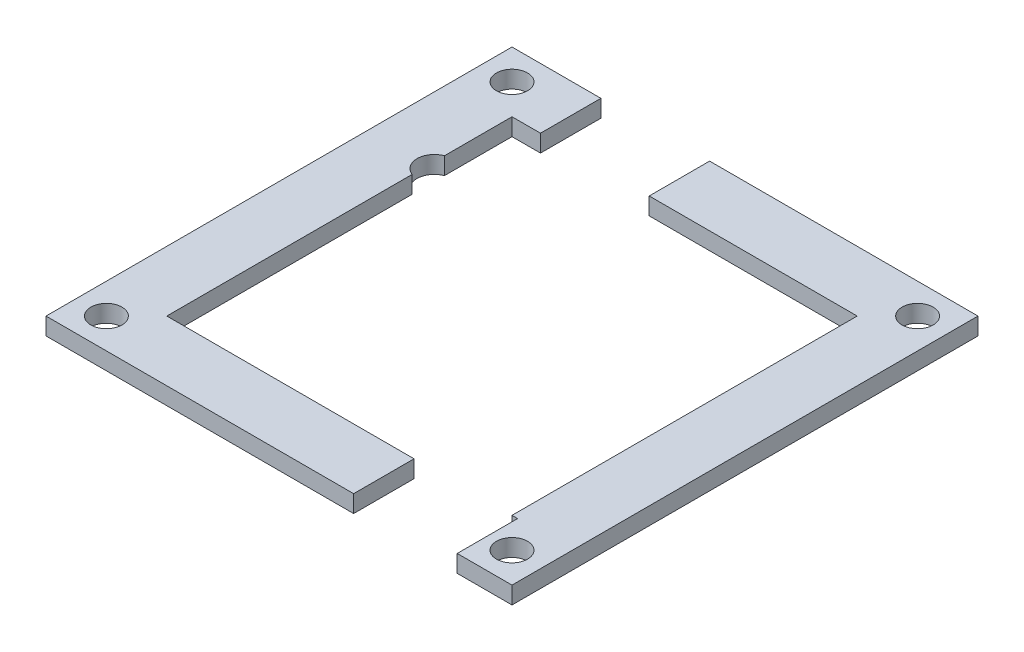
ISO-10303-21;
HEADER;
FILE_DESCRIPTION(('STEP AP214'),'2;1');
FILE_NAME('part.step','',(''),(''),'','','');
FILE_SCHEMA(('AUTOMOTIVE_DESIGN { 1 0 10303 214 1 1 1 1 }'));
ENDSEC;
DATA;
#1=APPLICATION_CONTEXT('core data for automotive mechanical design processes');
#2=APPLICATION_PROTOCOL_DEFINITION('international standard','automotive_design',2000,#1);
#3=PRODUCT_CONTEXT('',#1,'mechanical');
#4=PRODUCT('Part','Part','',(#3));
#5=PRODUCT_RELATED_PRODUCT_CATEGORY('part','',(#4));
#6=PRODUCT_DEFINITION_FORMATION('','',#4);
#7=PRODUCT_DEFINITION_CONTEXT('part definition',#1,'design');
#8=PRODUCT_DEFINITION('design','',#6,#7);
#9=PRODUCT_DEFINITION_SHAPE('','',#8);
#10=(LENGTH_UNIT() NAMED_UNIT(*) SI_UNIT(.MILLI.,.METRE.));
#11=(NAMED_UNIT(*) PLANE_ANGLE_UNIT() SI_UNIT($,.RADIAN.));
#12=(NAMED_UNIT(*) SI_UNIT($,.STERADIAN.) SOLID_ANGLE_UNIT());
#13=UNCERTAINTY_MEASURE_WITH_UNIT(LENGTH_MEASURE(1.E-05),#10,'distance_accuracy_value','');
#14=(GEOMETRIC_REPRESENTATION_CONTEXT(3) GLOBAL_UNCERTAINTY_ASSIGNED_CONTEXT((#13)) GLOBAL_UNIT_ASSIGNED_CONTEXT((#10,
#11,#12)) REPRESENTATION_CONTEXT('',''));
#15=CARTESIAN_POINT('',(0.,0.,0.));
#16=DIRECTION('',(0.,0.,1.));
#17=DIRECTION('',(1.,0.,0.));
#18=AXIS2_PLACEMENT_3D('',#15,#16,#17);
#19=CARTESIAN_POINT('',(-4.1,2.,0.));
#20=DIRECTION('',(-1.,0.,0.));
#21=DIRECTION('',(0.,0.,1.));
#22=AXIS2_PLACEMENT_3D('',#19,#20,#21);
#23=PLANE('',#22);
#24=DIRECTION('',(0.,0.,-1.));
#25=VECTOR('',#24,1.);
#26=CARTESIAN_POINT('',(-4.1,0.,0.));
#27=LINE('',#26,#25);
#28=CARTESIAN_POINT('',(-4.1,0.,-20.));
#29=VERTEX_POINT('',#28);
#30=CARTESIAN_POINT('',(-4.1,0.,-27.));
#31=VERTEX_POINT('',#30);
#32=EDGE_CURVE('E215',#29,#31,#27,.T.);
#33=ORIENTED_EDGE('',*,*,#32,.F.);
#34=DIRECTION('',(0.,-1.,0.));
#35=VECTOR('',#34,1.);
#36=CARTESIAN_POINT('',(-4.1,2.,-20.));
#37=LINE('',#36,#35);
#38=CARTESIAN_POINT('',(-4.1,2.,-20.));
#39=VERTEX_POINT('',#38);
#40=EDGE_CURVE('E13',#39,#29,#37,.T.);
#41=ORIENTED_EDGE('',*,*,#40,.F.);
#42=DIRECTION('',(0.,0.,-1.));
#43=VECTOR('',#42,1.);
#44=CARTESIAN_POINT('',(-4.1,2.,0.));
#45=LINE('',#44,#43);
#46=CARTESIAN_POINT('',(-4.1,2.,-27.));
#47=VERTEX_POINT('',#46);
#48=EDGE_CURVE('E355',#39,#47,#45,.T.);
#49=ORIENTED_EDGE('',*,*,#48,.T.);
#50=DIRECTION('',(0.,-1.,0.));
#51=VECTOR('',#50,1.);
#52=CARTESIAN_POINT('',(-4.1,2.,-27.));
#53=LINE('',#52,#51);
#54=EDGE_CURVE('E150',#47,#31,#53,.T.);
#55=ORIENTED_EDGE('',*,*,#54,.T.);
#56=EDGE_LOOP('',(#33,#41,#49,#55));
#57=FACE_BOUND('',#56,.T.);
#58=ADVANCED_FACE('F99',(#57),#23,.T.);
#59=CARTESIAN_POINT('',(0.,2.,-20.));
#60=DIRECTION('',(0.,0.,-1.));
#61=DIRECTION('',(-1.,0.,0.));
#62=AXIS2_PLACEMENT_3D('',#59,#60,#61);
#63=PLANE('',#62);
#64=DIRECTION('',(1.,0.,0.));
#65=VECTOR('',#64,1.);
#66=CARTESIAN_POINT('',(0.,0.,-20.));
#67=LINE('',#66,#65);
#68=CARTESIAN_POINT('',(20.,0.,-20.));
#69=VERTEX_POINT('',#68);
#70=EDGE_CURVE('E213',#29,#69,#67,.T.);
#71=ORIENTED_EDGE('',*,*,#70,.T.);
#72=DIRECTION('',(0.,-1.,0.));
#73=VECTOR('',#72,1.);
#74=CARTESIAN_POINT('',(20.,2.,-20.));
#75=LINE('',#74,#73);
#76=CARTESIAN_POINT('',(20.,2.,-20.));
#77=VERTEX_POINT('',#76);
#78=EDGE_CURVE('E108',#77,#69,#75,.T.);
#79=ORIENTED_EDGE('',*,*,#78,.F.);
#80=DIRECTION('',(1.,0.,0.));
#81=VECTOR('',#80,1.);
#82=CARTESIAN_POINT('',(0.,2.,-20.));
#83=LINE('',#82,#81);
#84=EDGE_CURVE('E352',#39,#77,#83,.T.);
#85=ORIENTED_EDGE('',*,*,#84,.F.);
#86=ORIENTED_EDGE('',*,*,#40,.T.);
#87=EDGE_LOOP('',(#71,#79,#85,#86));
#88=FACE_BOUND('',#87,.T.);
#89=ADVANCED_FACE('F214',(#88),#63,.F.);
#90=CARTESIAN_POINT('',(20.,2.,0.));
#91=DIRECTION('',(-1.,0.,0.));
#92=DIRECTION('',(0.,0.,1.));
#93=AXIS2_PLACEMENT_3D('',#90,#91,#92);
#94=PLANE('',#93);
#95=DIRECTION('',(0.,0.,-1.));
#96=VECTOR('',#95,1.);
#97=CARTESIAN_POINT('',(20.,0.,0.));
#98=LINE('',#97,#96);
#99=CARTESIAN_POINT('',(20.,0.,20.));
#100=VERTEX_POINT('',#99);
#101=EDGE_CURVE('E207',#100,#69,#98,.T.);
#102=ORIENTED_EDGE('',*,*,#101,.F.);
#103=DIRECTION('',(0.,-1.,0.));
#104=VECTOR('',#103,1.);
#105=CARTESIAN_POINT('',(20.,2.,20.));
#106=LINE('',#105,#104);
#107=CARTESIAN_POINT('',(20.,2.,20.));
#108=VERTEX_POINT('',#107);
#109=EDGE_CURVE('E199',#108,#100,#106,.T.);
#110=ORIENTED_EDGE('',*,*,#109,.F.);
#111=DIRECTION('',(0.,0.,-1.));
#112=VECTOR('',#111,1.);
#113=CARTESIAN_POINT('',(20.,2.,0.));
#114=LINE('',#113,#112);
#115=EDGE_CURVE('E210',#108,#77,#114,.T.);
#116=ORIENTED_EDGE('',*,*,#115,.T.);
#117=ORIENTED_EDGE('',*,*,#78,.T.);
#118=EDGE_LOOP('',(#102,#110,#116,#117));
#119=FACE_BOUND('',#118,.T.);
#120=ADVANCED_FACE('F205',(#119),#94,.T.);
#121=CARTESIAN_POINT('',(2.13504427812533E-13,2.,20.0000000000002));
#122=DIRECTION('',(0.,0.,1.));
#123=DIRECTION('',(1.,0.,0.));
#124=AXIS2_PLACEMENT_3D('',#121,#122,#123);
#125=PLANE('',#124);
#126=DIRECTION('',(-1.,0.,0.));
#127=VECTOR('',#126,1.);
#128=CARTESIAN_POINT('',(2.13504427812533E-13,0.,20.0000000000002));
#129=LINE('',#128,#127);
#130=CARTESIAN_POINT('',(20.65,0.,20.));
#131=VERTEX_POINT('',#130);
#132=EDGE_CURVE('E220',#131,#100,#129,.T.);
#133=ORIENTED_EDGE('',*,*,#132,.F.);
#134=DIRECTION('',(0.,-1.,0.));
#135=VECTOR('',#134,1.);
#136=CARTESIAN_POINT('',(20.65,2.,20.));
#137=LINE('',#136,#135);
#138=CARTESIAN_POINT('',(20.65,2.,20.));
#139=VERTEX_POINT('',#138);
#140=EDGE_CURVE('E193',#139,#131,#137,.T.);
#141=ORIENTED_EDGE('',*,*,#140,.F.);
#142=DIRECTION('',(-1.,0.,0.));
#143=VECTOR('',#142,1.);
#144=CARTESIAN_POINT('',(2.13504427812533E-13,2.,20.0000000000002));
#145=LINE('',#144,#143);
#146=EDGE_CURVE('E351',#139,#108,#145,.T.);
#147=ORIENTED_EDGE('',*,*,#146,.T.);
#148=ORIENTED_EDGE('',*,*,#109,.T.);
#149=EDGE_LOOP('',(#133,#141,#147,#148));
#150=FACE_BOUND('',#149,.T.);
#151=ADVANCED_FACE('F279',(#150),#125,.T.);
#152=CARTESIAN_POINT('',(20.65,2.,0.));
#153=DIRECTION('',(1.,0.,0.));
#154=DIRECTION('',(0.,0.,-1.));
#155=AXIS2_PLACEMENT_3D('',#152,#153,#154);
#156=PLANE('',#155);
#157=DIRECTION('',(0.,0.,1.));
#158=VECTOR('',#157,1.);
#159=CARTESIAN_POINT('',(20.65,0.,0.));
#160=LINE('',#159,#158);
#161=CARTESIAN_POINT('',(20.65,0.,27.));
#162=VERTEX_POINT('',#161);
#163=EDGE_CURVE('E222',#131,#162,#160,.T.);
#164=ORIENTED_EDGE('',*,*,#163,.T.);
#165=DIRECTION('',(0.,-1.,0.));
#166=VECTOR('',#165,1.);
#167=CARTESIAN_POINT('',(20.65,2.,27.));
#168=LINE('',#167,#166);
#169=CARTESIAN_POINT('',(20.65,2.,27.));
#170=VERTEX_POINT('',#169);
#171=EDGE_CURVE('E191',#170,#162,#168,.T.);
#172=ORIENTED_EDGE('',*,*,#171,.F.);
#173=DIRECTION('',(0.,0.,1.));
#174=VECTOR('',#173,1.);
#175=CARTESIAN_POINT('',(20.65,2.,0.));
#176=LINE('',#175,#174);
#177=EDGE_CURVE('E184',#139,#170,#176,.T.);
#178=ORIENTED_EDGE('',*,*,#177,.F.);
#179=ORIENTED_EDGE('',*,*,#140,.T.);
#180=EDGE_LOOP('',(#164,#172,#178,#179));
#181=FACE_BOUND('',#180,.T.);
#182=ADVANCED_FACE('F276',(#181),#156,.F.);
#183=CARTESIAN_POINT('',(0.,2.,27.));
#184=DIRECTION('',(0.,0.,-1.));
#185=DIRECTION('',(-1.,0.,0.));
#186=AXIS2_PLACEMENT_3D('',#183,#184,#185);
#187=PLANE('',#186);
#188=DIRECTION('',(1.,0.,0.));
#189=VECTOR('',#188,1.);
#190=CARTESIAN_POINT('',(0.,0.,27.));
#191=LINE('',#190,#189);
#192=CARTESIAN_POINT('',(27.,0.,27.));
#193=VERTEX_POINT('',#192);
#194=EDGE_CURVE('E190',#162,#193,#191,.T.);
#195=ORIENTED_EDGE('',*,*,#194,.T.);
#196=DIRECTION('',(0.,-1.,0.));
#197=VECTOR('',#196,1.);
#198=CARTESIAN_POINT('',(27.,2.,27.));
#199=LINE('',#198,#197);
#200=CARTESIAN_POINT('',(27.,2.,27.));
#201=VERTEX_POINT('',#200);
#202=EDGE_CURVE('E175',#201,#193,#199,.T.);
#203=ORIENTED_EDGE('',*,*,#202,.F.);
#204=DIRECTION('',(1.,0.,0.));
#205=VECTOR('',#204,1.);
#206=CARTESIAN_POINT('',(0.,2.,27.));
#207=LINE('',#206,#205);
#208=EDGE_CURVE('E178',#170,#201,#207,.T.);
#209=ORIENTED_EDGE('',*,*,#208,.F.);
#210=ORIENTED_EDGE('',*,*,#171,.T.);
#211=EDGE_LOOP('',(#195,#203,#209,#210));
#212=FACE_BOUND('',#211,.T.);
#213=ADVANCED_FACE('F189',(#212),#187,.F.);
#214=CARTESIAN_POINT('',(27.,2.,0.));
#215=DIRECTION('',(-1.,0.,0.));
#216=DIRECTION('',(0.,0.,1.));
#217=AXIS2_PLACEMENT_3D('',#214,#215,#216);
#218=PLANE('',#217);
#219=DIRECTION('',(0.,0.,-1.));
#220=VECTOR('',#219,1.);
#221=CARTESIAN_POINT('',(27.,0.,0.));
#222=LINE('',#221,#220);
#223=CARTESIAN_POINT('',(27.,0.,-27.));
#224=VERTEX_POINT('',#223);
#225=EDGE_CURVE('E229',#193,#224,#222,.T.);
#226=ORIENTED_EDGE('',*,*,#225,.T.);
#227=DIRECTION('',(0.,-1.,0.));
#228=VECTOR('',#227,1.);
#229=CARTESIAN_POINT('',(27.,2.,-27.));
#230=LINE('',#229,#228);
#231=CARTESIAN_POINT('',(27.,2.,-27.));
#232=VERTEX_POINT('',#231);
#233=EDGE_CURVE('E177',#232,#224,#230,.T.);
#234=ORIENTED_EDGE('',*,*,#233,.F.);
#235=DIRECTION('',(0.,0.,-1.));
#236=VECTOR('',#235,1.);
#237=CARTESIAN_POINT('',(27.,2.,0.));
#238=LINE('',#237,#236);
#239=EDGE_CURVE('E170',#201,#232,#238,.T.);
#240=ORIENTED_EDGE('',*,*,#239,.F.);
#241=ORIENTED_EDGE('',*,*,#202,.T.);
#242=EDGE_LOOP('',(#226,#234,#240,#241));
#243=FACE_BOUND('',#242,.T.);
#244=ADVANCED_FACE('F173',(#243),#218,.F.);
#245=CARTESIAN_POINT('',(23.5,2.,23.5));
#246=DIRECTION('',(0.,-1.,0.));
#247=DIRECTION('',(0.,0.,-1.));
#248=AXIS2_PLACEMENT_3D('',#245,#246,#247);
#249=CYLINDRICAL_SURFACE('',#248,1.8);
#250=CARTESIAN_POINT('',(23.5,2.,23.5));
#251=DIRECTION('',(0.,1.,0.));
#252=DIRECTION('',(0.,0.,1.));
#253=AXIS2_PLACEMENT_3D('',#250,#251,#252);
#254=CIRCLE('',#253,1.8);
#255=CARTESIAN_POINT('',(23.5,2.,25.3));
#256=VERTEX_POINT('',#255);
#257=EDGE_CURVE('E259',#256,#256,#254,.T.);
#258=ORIENTED_EDGE('',*,*,#257,.T.);
#259=EDGE_LOOP('',(#258));
#260=FACE_BOUND('',#259,.T.);
#261=CARTESIAN_POINT('',(23.5,0.,23.5));
#262=DIRECTION('',(0.,1.,0.));
#263=DIRECTION('',(0.,0.,1.));
#264=AXIS2_PLACEMENT_3D('',#261,#262,#263);
#265=CIRCLE('',#264,1.8);
#266=CARTESIAN_POINT('',(23.5,0.,25.3));
#267=VERTEX_POINT('',#266);
#268=EDGE_CURVE('E237',#267,#267,#265,.T.);
#269=ORIENTED_EDGE('',*,*,#268,.F.);
#270=EDGE_LOOP('',(#269));
#271=FACE_BOUND('',#270,.T.);
#272=ADVANCED_FACE('F246',(#260,#271),#249,.F.);
#273=CARTESIAN_POINT('',(23.5,2.,-23.5));
#274=DIRECTION('',(0.,-1.,0.));
#275=DIRECTION('',(0.,0.,-1.));
#276=AXIS2_PLACEMENT_3D('',#273,#274,#275);
#277=CYLINDRICAL_SURFACE('',#276,1.8);
#278=CARTESIAN_POINT('',(23.5,2.,-23.5));
#279=DIRECTION('',(0.,1.,0.));
#280=DIRECTION('',(0.,0.,1.));
#281=AXIS2_PLACEMENT_3D('',#278,#279,#280);
#282=CIRCLE('',#281,1.8);
#283=CARTESIAN_POINT('',(23.5,2.,-21.7));
#284=VERTEX_POINT('',#283);
#285=EDGE_CURVE('E231',#284,#284,#282,.T.);
#286=ORIENTED_EDGE('',*,*,#285,.T.);
#287=EDGE_LOOP('',(#286));
#288=FACE_BOUND('',#287,.T.);
#289=CARTESIAN_POINT('',(23.5,0.,-23.5));
#290=DIRECTION('',(0.,1.,0.));
#291=DIRECTION('',(0.,0.,1.));
#292=AXIS2_PLACEMENT_3D('',#289,#290,#291);
#293=CIRCLE('',#292,1.8);
#294=CARTESIAN_POINT('',(23.5,0.,-21.7));
#295=VERTEX_POINT('',#294);
#296=EDGE_CURVE('E234',#295,#295,#293,.T.);
#297=ORIENTED_EDGE('',*,*,#296,.F.);
#298=EDGE_LOOP('',(#297));
#299=FACE_BOUND('',#298,.T.);
#300=ADVANCED_FACE('F101',(#288,#299),#277,.F.);
#301=CARTESIAN_POINT('',(0.,2.,-27.));
#302=DIRECTION('',(0.,0.,1.));
#303=DIRECTION('',(1.,0.,0.));
#304=AXIS2_PLACEMENT_3D('',#301,#302,#303);
#305=PLANE('',#304);
#306=DIRECTION('',(-1.,0.,0.));
#307=VECTOR('',#306,1.);
#308=CARTESIAN_POINT('',(0.,0.,-27.));
#309=LINE('',#308,#307);
#310=EDGE_CURVE('E143',#224,#31,#309,.T.);
#311=ORIENTED_EDGE('',*,*,#310,.T.);
#312=ORIENTED_EDGE('',*,*,#54,.F.);
#313=DIRECTION('',(-1.,0.,0.));
#314=VECTOR('',#313,1.);
#315=CARTESIAN_POINT('',(0.,2.,-27.));
#316=LINE('',#315,#314);
#317=EDGE_CURVE('E116',#232,#47,#316,.T.);
#318=ORIENTED_EDGE('',*,*,#317,.F.);
#319=ORIENTED_EDGE('',*,*,#233,.T.);
#320=EDGE_LOOP('',(#311,#312,#318,#319));
#321=FACE_BOUND('',#320,.T.);
#322=ADVANCED_FACE('F253',(#321),#305,.F.);
#323=CARTESIAN_POINT('',(0.,2.,0.));
#324=DIRECTION('',(0.,1.,0.));
#325=DIRECTION('',(0.,0.,1.));
#326=AXIS2_PLACEMENT_3D('',#323,#324,#325);
#327=PLANE('',#326);
#328=ORIENTED_EDGE('',*,*,#285,.F.);
#329=EDGE_LOOP('',(#328));
#330=FACE_BOUND('',#329,.T.);
#331=ORIENTED_EDGE('',*,*,#257,.F.);
#332=EDGE_LOOP('',(#331));
#333=FACE_BOUND('',#332,.T.);
#334=ORIENTED_EDGE('',*,*,#48,.F.);
#335=ORIENTED_EDGE('',*,*,#84,.T.);
#336=ORIENTED_EDGE('',*,*,#115,.F.);
#337=ORIENTED_EDGE('',*,*,#146,.F.);
#338=ORIENTED_EDGE('',*,*,#177,.T.);
#339=ORIENTED_EDGE('',*,*,#208,.T.);
#340=ORIENTED_EDGE('',*,*,#239,.T.);
#341=ORIENTED_EDGE('',*,*,#317,.T.);
#342=EDGE_LOOP('',(#334,#335,#336,#337,#338,#339,#340,#341));
#343=FACE_BOUND('',#342,.T.);
#344=ADVANCED_FACE('F181',(#330,#333,#343),#327,.T.);
#345=CARTESIAN_POINT('',(0.,0.,0.));
#346=DIRECTION('',(0.,1.,0.));
#347=DIRECTION('',(0.,0.,1.));
#348=AXIS2_PLACEMENT_3D('',#345,#346,#347);
#349=PLANE('',#348);
#350=ORIENTED_EDGE('',*,*,#296,.T.);
#351=EDGE_LOOP('',(#350));
#352=FACE_BOUND('',#351,.T.);
#353=ORIENTED_EDGE('',*,*,#268,.T.);
#354=EDGE_LOOP('',(#353));
#355=FACE_BOUND('',#354,.T.);
#356=ORIENTED_EDGE('',*,*,#32,.T.);
#357=ORIENTED_EDGE('',*,*,#310,.F.);
#358=ORIENTED_EDGE('',*,*,#225,.F.);
#359=ORIENTED_EDGE('',*,*,#194,.F.);
#360=ORIENTED_EDGE('',*,*,#163,.F.);
#361=ORIENTED_EDGE('',*,*,#132,.T.);
#362=ORIENTED_EDGE('',*,*,#101,.T.);
#363=ORIENTED_EDGE('',*,*,#70,.F.);
#364=EDGE_LOOP('',(#356,#357,#358,#359,#360,#361,#362,#363));
#365=FACE_BOUND('',#364,.T.);
#366=ADVANCED_FACE('F217',(#352,#355,#365),#349,.F.);
#367=CLOSED_SHELL('',(#58,#89,#120,#151,#182,#213,#244,#272,#300,#322,#344,#366));
#368=MANIFOLD_SOLID_BREP('B2',#367);
#369=CARTESIAN_POINT('',(-19.3,2.,-10.3));
#370=DIRECTION('',(0.,-1.,0.));
#371=DIRECTION('',(0.,0.,-1.));
#372=AXIS2_PLACEMENT_3D('',#369,#370,#371);
#373=CYLINDRICAL_SURFACE('',#372,2.);
#374=CARTESIAN_POINT('',(-19.3,0.,-10.3));
#375=DIRECTION('',(0.,1.,0.));
#376=DIRECTION('',(0.,0.,1.));
#377=AXIS2_PLACEMENT_3D('',#374,#375,#376);
#378=CIRCLE('',#377,2.);
#379=CARTESIAN_POINT('',(-20.,0.,-12.1734993995195));
#380=VERTEX_POINT('',#379);
#381=CARTESIAN_POINT('',(-20.,0.,-8.42650060048048));
#382=VERTEX_POINT('',#381);
#383=EDGE_CURVE('E481',#380,#382,#378,.T.);
#384=ORIENTED_EDGE('',*,*,#383,.F.);
#385=DIRECTION('',(0.,-1.,0.));
#386=VECTOR('',#385,1.);
#387=CARTESIAN_POINT('',(-20.,2.,-12.1734993995195));
#388=LINE('',#387,#386);
#389=CARTESIAN_POINT('',(-20.,2.,-12.1734993995195));
#390=VERTEX_POINT('',#389);
#391=EDGE_CURVE('E97',#390,#380,#388,.T.);
#392=ORIENTED_EDGE('',*,*,#391,.F.);
#393=CARTESIAN_POINT('',(-19.3,2.,-10.3));
#394=DIRECTION('',(0.,1.,0.));
#395=DIRECTION('',(0.,0.,1.));
#396=AXIS2_PLACEMENT_3D('',#393,#394,#395);
#397=CIRCLE('',#396,2.);
#398=CARTESIAN_POINT('',(-20.,2.,-8.42650060048048));
#399=VERTEX_POINT('',#398);
#400=EDGE_CURVE('E507',#390,#399,#397,.T.);
#401=ORIENTED_EDGE('',*,*,#400,.T.);
#402=DIRECTION('',(0.,-1.,0.));
#403=VECTOR('',#402,1.);
#404=CARTESIAN_POINT('',(-20.,2.,-8.42650060048048));
#405=LINE('',#404,#403);
#406=EDGE_CURVE('E385',#399,#382,#405,.T.);
#407=ORIENTED_EDGE('',*,*,#406,.T.);
#408=EDGE_LOOP('',(#384,#392,#401,#407));
#409=FACE_BOUND('',#408,.T.);
#410=ADVANCED_FACE('F369',(#409),#373,.F.);
#411=CARTESIAN_POINT('',(-20.,2.,0.));
#412=DIRECTION('',(1.,0.,0.));
#413=DIRECTION('',(0.,0.,-1.));
#414=AXIS2_PLACEMENT_3D('',#411,#412,#413);
#415=PLANE('',#414);
#416=DIRECTION('',(0.,0.,1.));
#417=VECTOR('',#416,1.);
#418=CARTESIAN_POINT('',(-20.,0.,0.));
#419=LINE('',#418,#417);
#420=CARTESIAN_POINT('',(-20.,0.,-20.));
#421=VERTEX_POINT('',#420);
#422=EDGE_CURVE('E483',#421,#380,#419,.T.);
#423=ORIENTED_EDGE('',*,*,#422,.F.);
#424=DIRECTION('',(0.,-1.,0.));
#425=VECTOR('',#424,1.);
#426=CARTESIAN_POINT('',(-20.,2.,-20.));
#427=LINE('',#426,#425);
#428=CARTESIAN_POINT('',(-20.,2.,-20.));
#429=VERTEX_POINT('',#428);
#430=EDGE_CURVE('E377',#429,#421,#427,.T.);
#431=ORIENTED_EDGE('',*,*,#430,.F.);
#432=DIRECTION('',(0.,0.,1.));
#433=VECTOR('',#432,1.);
#434=CARTESIAN_POINT('',(-20.,2.,0.));
#435=LINE('',#434,#433);
#436=EDGE_CURVE('E473',#429,#390,#435,.T.);
#437=ORIENTED_EDGE('',*,*,#436,.T.);
#438=ORIENTED_EDGE('',*,*,#391,.T.);
#439=EDGE_LOOP('',(#423,#431,#437,#438));
#440=FACE_BOUND('',#439,.T.);
#441=ADVANCED_FACE('F537',(#440),#415,.T.);
#442=CARTESIAN_POINT('',(0.,2.,-20.));
#443=DIRECTION('',(0.,0.,-1.));
#444=DIRECTION('',(-1.,0.,0.));
#445=AXIS2_PLACEMENT_3D('',#442,#443,#444);
#446=PLANE('',#445);
#447=DIRECTION('',(1.,0.,0.));
#448=VECTOR('',#447,1.);
#449=CARTESIAN_POINT('',(0.,0.,-20.));
#450=LINE('',#449,#448);
#451=CARTESIAN_POINT('',(-16.7,0.,-20.));
#452=VERTEX_POINT('',#451);
#453=EDGE_CURVE('E486',#421,#452,#450,.T.);
#454=ORIENTED_EDGE('',*,*,#453,.T.);
#455=DIRECTION('',(0.,-1.,0.));
#456=VECTOR('',#455,1.);
#457=CARTESIAN_POINT('',(-16.7,2.,-20.));
#458=LINE('',#457,#456);
#459=CARTESIAN_POINT('',(-16.7,2.,-20.));
#460=VERTEX_POINT('',#459);
#461=EDGE_CURVE('E520',#460,#452,#458,.T.);
#462=ORIENTED_EDGE('',*,*,#461,.F.);
#463=DIRECTION('',(1.,0.,0.));
#464=VECTOR('',#463,1.);
#465=CARTESIAN_POINT('',(0.,2.,-20.));
#466=LINE('',#465,#464);
#467=EDGE_CURVE('E527',#429,#460,#466,.T.);
#468=ORIENTED_EDGE('',*,*,#467,.F.);
#469=ORIENTED_EDGE('',*,*,#430,.T.);
#470=EDGE_LOOP('',(#454,#462,#468,#469));
#471=FACE_BOUND('',#470,.T.);
#472=ADVANCED_FACE('F525',(#471),#446,.F.);
#473=CARTESIAN_POINT('',(-16.7,2.,0.));
#474=DIRECTION('',(-1.,0.,0.));
#475=DIRECTION('',(0.,0.,1.));
#476=AXIS2_PLACEMENT_3D('',#473,#474,#475);
#477=PLANE('',#476);
#478=DIRECTION('',(0.,0.,-1.));
#479=VECTOR('',#478,1.);
#480=CARTESIAN_POINT('',(-16.7,0.,0.));
#481=LINE('',#480,#479);
#482=CARTESIAN_POINT('',(-16.7,0.,-27.));
#483=VERTEX_POINT('',#482);
#484=EDGE_CURVE('E489',#452,#483,#481,.T.);
#485=ORIENTED_EDGE('',*,*,#484,.T.);
#486=DIRECTION('',(0.,-1.,0.));
#487=VECTOR('',#486,1.);
#488=CARTESIAN_POINT('',(-16.7,2.,-27.));
#489=LINE('',#488,#487);
#490=CARTESIAN_POINT('',(-16.7,2.,-27.));
#491=VERTEX_POINT('',#490);
#492=EDGE_CURVE('E517',#491,#483,#489,.T.);
#493=ORIENTED_EDGE('',*,*,#492,.F.);
#494=DIRECTION('',(0.,0.,-1.));
#495=VECTOR('',#494,1.);
#496=CARTESIAN_POINT('',(-16.7,2.,0.));
#497=LINE('',#496,#495);
#498=EDGE_CURVE('E671',#460,#491,#497,.T.);
#499=ORIENTED_EDGE('',*,*,#498,.F.);
#500=ORIENTED_EDGE('',*,*,#461,.T.);
#501=EDGE_LOOP('',(#485,#493,#499,#500));
#502=FACE_BOUND('',#501,.T.);
#503=ADVANCED_FACE('F567',(#502),#477,.F.);
#504=CARTESIAN_POINT('',(0.,2.,-27.));
#505=DIRECTION('',(0.,0.,1.));
#506=DIRECTION('',(1.,0.,0.));
#507=AXIS2_PLACEMENT_3D('',#504,#505,#506);
#508=PLANE('',#507);
#509=DIRECTION('',(-1.,0.,0.));
#510=VECTOR('',#509,1.);
#511=CARTESIAN_POINT('',(0.,0.,-27.));
#512=LINE('',#511,#510);
#513=CARTESIAN_POINT('',(-27.,0.,-27.));
#514=VERTEX_POINT('',#513);
#515=EDGE_CURVE('E491',#483,#514,#512,.T.);
#516=ORIENTED_EDGE('',*,*,#515,.T.);
#517=DIRECTION('',(0.,-1.,0.));
#518=VECTOR('',#517,1.);
#519=CARTESIAN_POINT('',(-27.,2.,-27.));
#520=LINE('',#519,#518);
#521=CARTESIAN_POINT('',(-27.,2.,-27.));
#522=VERTEX_POINT('',#521);
#523=EDGE_CURVE('E514',#522,#514,#520,.T.);
#524=ORIENTED_EDGE('',*,*,#523,.F.);
#525=DIRECTION('',(-1.,0.,0.));
#526=VECTOR('',#525,1.);
#527=CARTESIAN_POINT('',(0.,2.,-27.));
#528=LINE('',#527,#526);
#529=EDGE_CURVE('E668',#491,#522,#528,.T.);
#530=ORIENTED_EDGE('',*,*,#529,.F.);
#531=ORIENTED_EDGE('',*,*,#492,.T.);
#532=EDGE_LOOP('',(#516,#524,#530,#531));
#533=FACE_BOUND('',#532,.T.);
#534=ADVANCED_FACE('F573',(#533),#508,.F.);
#535=CARTESIAN_POINT('',(-27.,2.,0.));
#536=DIRECTION('',(1.,0.,0.));
#537=DIRECTION('',(0.,0.,-1.));
#538=AXIS2_PLACEMENT_3D('',#535,#536,#537);
#539=PLANE('',#538);
#540=DIRECTION('',(0.,0.,1.));
#541=VECTOR('',#540,1.);
#542=CARTESIAN_POINT('',(-27.,0.,0.));
#543=LINE('',#542,#541);
#544=CARTESIAN_POINT('',(-27.,0.,27.));
#545=VERTEX_POINT('',#544);
#546=EDGE_CURVE('E493',#514,#545,#543,.T.);
#547=ORIENTED_EDGE('',*,*,#546,.T.);
#548=DIRECTION('',(0.,-1.,0.));
#549=VECTOR('',#548,1.);
#550=CARTESIAN_POINT('',(-27.,2.,27.));
#551=LINE('',#550,#549);
#552=CARTESIAN_POINT('',(-27.,2.,27.));
#553=VERTEX_POINT('',#552);
#554=EDGE_CURVE('E511',#553,#545,#551,.T.);
#555=ORIENTED_EDGE('',*,*,#554,.F.);
#556=DIRECTION('',(0.,0.,1.));
#557=VECTOR('',#556,1.);
#558=CARTESIAN_POINT('',(-27.,2.,0.));
#559=LINE('',#558,#557);
#560=EDGE_CURVE('E666',#522,#553,#559,.T.);
#561=ORIENTED_EDGE('',*,*,#560,.F.);
#562=ORIENTED_EDGE('',*,*,#523,.T.);
#563=EDGE_LOOP('',(#547,#555,#561,#562));
#564=FACE_BOUND('',#563,.T.);
#565=ADVANCED_FACE('F581',(#564),#539,.F.);
#566=CARTESIAN_POINT('',(0.,2.,27.));
#567=DIRECTION('',(0.,0.,-1.));
#568=DIRECTION('',(-1.,0.,0.));
#569=AXIS2_PLACEMENT_3D('',#566,#567,#568);
#570=PLANE('',#569);
#571=DIRECTION('',(1.,0.,0.));
#572=VECTOR('',#571,1.);
#573=CARTESIAN_POINT('',(0.,0.,27.));
#574=LINE('',#573,#572);
#575=CARTESIAN_POINT('',(8.65,0.,27.));
#576=VERTEX_POINT('',#575);
#577=EDGE_CURVE('E495',#545,#576,#574,.T.);
#578=ORIENTED_EDGE('',*,*,#577,.T.);
#579=DIRECTION('',(0.,-1.,0.));
#580=VECTOR('',#579,1.);
#581=CARTESIAN_POINT('',(8.65,2.,27.));
#582=LINE('',#581,#580);
#583=CARTESIAN_POINT('',(8.65,2.,27.));
#584=VERTEX_POINT('',#583);
#585=EDGE_CURVE('E456',#584,#576,#582,.T.);
#586=ORIENTED_EDGE('',*,*,#585,.F.);
#587=DIRECTION('',(1.,0.,0.));
#588=VECTOR('',#587,1.);
#589=CARTESIAN_POINT('',(0.,2.,27.));
#590=LINE('',#589,#588);
#591=EDGE_CURVE('E465',#553,#584,#590,.T.);
#592=ORIENTED_EDGE('',*,*,#591,.F.);
#593=ORIENTED_EDGE('',*,*,#554,.T.);
#594=EDGE_LOOP('',(#578,#586,#592,#593));
#595=FACE_BOUND('',#594,.T.);
#596=ADVANCED_FACE('F589',(#595),#570,.F.);
#597=CARTESIAN_POINT('',(8.65,2.,0.));
#598=DIRECTION('',(1.,0.,0.));
#599=DIRECTION('',(0.,0.,-1.));
#600=AXIS2_PLACEMENT_3D('',#597,#598,#599);
#601=PLANE('',#600);
#602=DIRECTION('',(0.,0.,1.));
#603=VECTOR('',#602,1.);
#604=CARTESIAN_POINT('',(8.65,0.,0.));
#605=LINE('',#604,#603);
#606=CARTESIAN_POINT('',(8.65,0.,20.));
#607=VERTEX_POINT('',#606);
#608=EDGE_CURVE('E452',#607,#576,#605,.T.);
#609=ORIENTED_EDGE('',*,*,#608,.F.);
#610=DIRECTION('',(0.,-1.,0.));
#611=VECTOR('',#610,1.);
#612=CARTESIAN_POINT('',(8.65,2.,20.));
#613=LINE('',#612,#611);
#614=CARTESIAN_POINT('',(8.65,2.,20.));
#615=VERTEX_POINT('',#614);
#616=EDGE_CURVE('E447',#615,#607,#613,.T.);
#617=ORIENTED_EDGE('',*,*,#616,.F.);
#618=DIRECTION('',(0.,0.,1.));
#619=VECTOR('',#618,1.);
#620=CARTESIAN_POINT('',(8.65,2.,0.));
#621=LINE('',#620,#619);
#622=EDGE_CURVE('E450',#615,#584,#621,.T.);
#623=ORIENTED_EDGE('',*,*,#622,.T.);
#624=ORIENTED_EDGE('',*,*,#585,.T.);
#625=EDGE_LOOP('',(#609,#617,#623,#624));
#626=FACE_BOUND('',#625,.T.);
#627=ADVANCED_FACE('F449',(#626),#601,.T.);
#628=CARTESIAN_POINT('',(0.,2.,20.));
#629=DIRECTION('',(0.,0.,-1.));
#630=DIRECTION('',(-1.,0.,0.));
#631=AXIS2_PLACEMENT_3D('',#628,#629,#630);
#632=PLANE('',#631);
#633=DIRECTION('',(1.,0.,0.));
#634=VECTOR('',#633,1.);
#635=CARTESIAN_POINT('',(0.,0.,20.));
#636=LINE('',#635,#634);
#637=CARTESIAN_POINT('',(-20.,0.,20.));
#638=VERTEX_POINT('',#637);
#639=EDGE_CURVE('E499',#638,#607,#636,.T.);
#640=ORIENTED_EDGE('',*,*,#639,.F.);
#641=DIRECTION('',(0.,-1.,0.));
#642=VECTOR('',#641,1.);
#643=CARTESIAN_POINT('',(-20.,2.,20.));
#644=LINE('',#643,#642);
#645=CARTESIAN_POINT('',(-20.,2.,20.));
#646=VERTEX_POINT('',#645);
#647=EDGE_CURVE('E416',#646,#638,#644,.T.);
#648=ORIENTED_EDGE('',*,*,#647,.F.);
#649=DIRECTION('',(1.,0.,0.));
#650=VECTOR('',#649,1.);
#651=CARTESIAN_POINT('',(0.,2.,20.));
#652=LINE('',#651,#650);
#653=EDGE_CURVE('E463',#646,#615,#652,.T.);
#654=ORIENTED_EDGE('',*,*,#653,.T.);
#655=ORIENTED_EDGE('',*,*,#616,.T.);
#656=EDGE_LOOP('',(#640,#648,#654,#655));
#657=FACE_BOUND('',#656,.T.);
#658=ADVANCED_FACE('F468',(#657),#632,.T.);
#659=CARTESIAN_POINT('',(-23.5,2.,-23.5));
#660=DIRECTION('',(0.,-1.,0.));
#661=DIRECTION('',(0.,0.,-1.));
#662=AXIS2_PLACEMENT_3D('',#659,#660,#661);
#663=CYLINDRICAL_SURFACE('',#662,1.8);
#664=CARTESIAN_POINT('',(-23.5,2.,-23.5));
#665=DIRECTION('',(0.,1.,0.));
#666=DIRECTION('',(0.,0.,1.));
#667=AXIS2_PLACEMENT_3D('',#664,#665,#666);
#668=CIRCLE('',#667,1.8);
#669=CARTESIAN_POINT('',(-23.5,2.,-21.7));
#670=VERTEX_POINT('',#669);
#671=EDGE_CURVE('E471',#670,#670,#668,.T.);
#672=ORIENTED_EDGE('',*,*,#671,.T.);
#673=EDGE_LOOP('',(#672));
#674=FACE_BOUND('',#673,.T.);
#675=CARTESIAN_POINT('',(-23.5,0.,-23.5));
#676=DIRECTION('',(0.,1.,0.));
#677=DIRECTION('',(0.,0.,1.));
#678=AXIS2_PLACEMENT_3D('',#675,#676,#677);
#679=CIRCLE('',#678,1.8);
#680=CARTESIAN_POINT('',(-23.5,0.,-21.7));
#681=VERTEX_POINT('',#680);
#682=EDGE_CURVE('E501',#681,#681,#679,.T.);
#683=ORIENTED_EDGE('',*,*,#682,.F.);
#684=EDGE_LOOP('',(#683));
#685=FACE_BOUND('',#684,.T.);
#686=ADVANCED_FACE('F542',(#674,#685),#663,.F.);
#687=EDGE_CURVE('E487',#382,#638,#419,.T.);
#688=ORIENTED_EDGE('',*,*,#687,.F.);
#689=ORIENTED_EDGE('',*,*,#406,.F.);
#690=EDGE_CURVE('E469',#399,#646,#435,.T.);
#691=ORIENTED_EDGE('',*,*,#690,.T.);
#692=ORIENTED_EDGE('',*,*,#647,.T.);
#693=EDGE_LOOP('',(#688,#689,#691,#692));
#694=FACE_BOUND('',#693,.T.);
#695=ADVANCED_FACE('F539',(#694),#415,.T.);
#696=CARTESIAN_POINT('',(-23.5,2.,23.5));
#697=DIRECTION('',(0.,-1.,0.));
#698=DIRECTION('',(0.,0.,-1.));
#699=AXIS2_PLACEMENT_3D('',#696,#697,#698);
#700=CYLINDRICAL_SURFACE('',#699,1.8);
#701=CARTESIAN_POINT('',(-23.5,2.,23.5));
#702=DIRECTION('',(0.,1.,0.));
#703=DIRECTION('',(0.,0.,1.));
#704=AXIS2_PLACEMENT_3D('',#701,#702,#703);
#705=CIRCLE('',#704,1.8);
#706=CARTESIAN_POINT('',(-23.5,2.,25.3));
#707=VERTEX_POINT('',#706);
#708=EDGE_CURVE('E478',#707,#707,#705,.T.);
#709=ORIENTED_EDGE('',*,*,#708,.T.);
#710=EDGE_LOOP('',(#709));
#711=FACE_BOUND('',#710,.T.);
#712=CARTESIAN_POINT('',(-23.5,0.,23.5));
#713=DIRECTION('',(0.,1.,0.));
#714=DIRECTION('',(0.,0.,1.));
#715=AXIS2_PLACEMENT_3D('',#712,#713,#714);
#716=CIRCLE('',#715,1.8);
#717=CARTESIAN_POINT('',(-23.5,0.,25.3));
#718=VERTEX_POINT('',#717);
#719=EDGE_CURVE('E504',#718,#718,#716,.T.);
#720=ORIENTED_EDGE('',*,*,#719,.F.);
#721=EDGE_LOOP('',(#720));
#722=FACE_BOUND('',#721,.T.);
#723=ADVANCED_FACE('F541',(#711,#722),#700,.F.);
#724=CARTESIAN_POINT('',(0.,2.,0.));
#725=DIRECTION('',(0.,1.,0.));
#726=DIRECTION('',(0.,0.,1.));
#727=AXIS2_PLACEMENT_3D('',#724,#725,#726);
#728=PLANE('',#727);
#729=ORIENTED_EDGE('',*,*,#400,.F.);
#730=ORIENTED_EDGE('',*,*,#436,.F.);
#731=ORIENTED_EDGE('',*,*,#467,.T.);
#732=ORIENTED_EDGE('',*,*,#498,.T.);
#733=ORIENTED_EDGE('',*,*,#529,.T.);
#734=ORIENTED_EDGE('',*,*,#560,.T.);
#735=ORIENTED_EDGE('',*,*,#591,.T.);
#736=ORIENTED_EDGE('',*,*,#622,.F.);
#737=ORIENTED_EDGE('',*,*,#653,.F.);
#738=ORIENTED_EDGE('',*,*,#690,.F.);
#739=EDGE_LOOP('',(#729,#730,#731,#732,#733,#734,#735,#736,#737,#738));
#740=FACE_BOUND('',#739,.T.);
#741=ORIENTED_EDGE('',*,*,#671,.F.);
#742=EDGE_LOOP('',(#741));
#743=FACE_BOUND('',#742,.T.);
#744=ORIENTED_EDGE('',*,*,#708,.F.);
#745=EDGE_LOOP('',(#744));
#746=FACE_BOUND('',#745,.T.);
#747=ADVANCED_FACE('F460',(#740,#743,#746),#728,.T.);
#748=CARTESIAN_POINT('',(0.,0.,0.));
#749=DIRECTION('',(0.,1.,0.));
#750=DIRECTION('',(0.,0.,1.));
#751=AXIS2_PLACEMENT_3D('',#748,#749,#750);
#752=PLANE('',#751);
#753=ORIENTED_EDGE('',*,*,#383,.T.);
#754=ORIENTED_EDGE('',*,*,#687,.T.);
#755=ORIENTED_EDGE('',*,*,#639,.T.);
#756=ORIENTED_EDGE('',*,*,#608,.T.);
#757=ORIENTED_EDGE('',*,*,#577,.F.);
#758=ORIENTED_EDGE('',*,*,#546,.F.);
#759=ORIENTED_EDGE('',*,*,#515,.F.);
#760=ORIENTED_EDGE('',*,*,#484,.F.);
#761=ORIENTED_EDGE('',*,*,#453,.F.);
#762=ORIENTED_EDGE('',*,*,#422,.T.);
#763=EDGE_LOOP('',(#753,#754,#755,#756,#757,#758,#759,#760,#761,#762));
#764=FACE_BOUND('',#763,.T.);
#765=ORIENTED_EDGE('',*,*,#682,.T.);
#766=EDGE_LOOP('',(#765));
#767=FACE_BOUND('',#766,.T.);
#768=ORIENTED_EDGE('',*,*,#719,.T.);
#769=EDGE_LOOP('',(#768));
#770=FACE_BOUND('',#769,.T.);
#771=ADVANCED_FACE('F534',(#764,#767,#770),#752,.F.);
#772=CLOSED_SHELL('',(#410,#441,#472,#503,#534,#565,#596,#627,#658,#686,#695,#723,#747,#771));
#773=MANIFOLD_SOLID_BREP('B7',#772);
#774=ADVANCED_BREP_SHAPE_REPRESENTATION('',(#18,#368,#773),#14);
#775=SHAPE_DEFINITION_REPRESENTATION(#9,#774);
ENDSEC;
END-ISO-10303-21;
